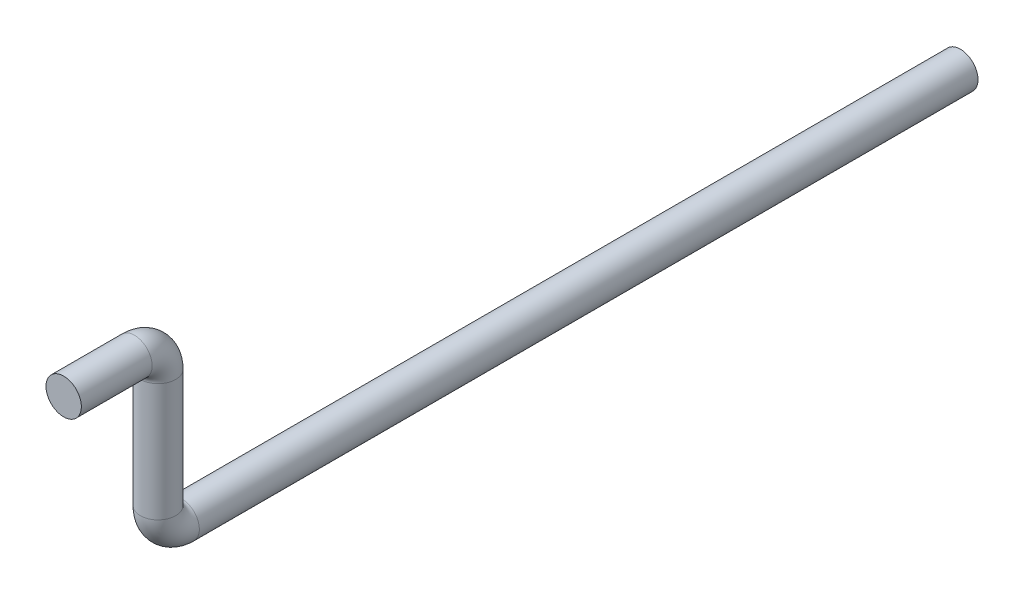
ISO-10303-21;
HEADER;
FILE_DESCRIPTION(('STEP AP214'),'2;1');
FILE_NAME('part.step','',(''),(''),'','','');
FILE_SCHEMA(('AUTOMOTIVE_DESIGN { 1 0 10303 214 1 1 1 1 }'));
ENDSEC;
DATA;
#1=APPLICATION_CONTEXT('core data for automotive mechanical design processes');
#2=APPLICATION_PROTOCOL_DEFINITION('international standard','automotive_design',2000,#1);
#3=PRODUCT_CONTEXT('',#1,'mechanical');
#4=PRODUCT('Part','Part','',(#3));
#5=PRODUCT_RELATED_PRODUCT_CATEGORY('part','',(#4));
#6=PRODUCT_DEFINITION_FORMATION('','',#4);
#7=PRODUCT_DEFINITION_CONTEXT('part definition',#1,'design');
#8=PRODUCT_DEFINITION('design','',#6,#7);
#9=PRODUCT_DEFINITION_SHAPE('','',#8);
#10=(LENGTH_UNIT() NAMED_UNIT(*) SI_UNIT(.MILLI.,.METRE.));
#11=(NAMED_UNIT(*) PLANE_ANGLE_UNIT() SI_UNIT($,.RADIAN.));
#12=(NAMED_UNIT(*) SI_UNIT($,.STERADIAN.) SOLID_ANGLE_UNIT());
#13=UNCERTAINTY_MEASURE_WITH_UNIT(LENGTH_MEASURE(1.E-05),#10,'distance_accuracy_value','');
#14=(GEOMETRIC_REPRESENTATION_CONTEXT(3) GLOBAL_UNCERTAINTY_ASSIGNED_CONTEXT((#13)) GLOBAL_UNIT_ASSIGNED_CONTEXT((#10,
#11,#12)) REPRESENTATION_CONTEXT('',''));
#15=CARTESIAN_POINT('',(0.,0.,0.));
#16=DIRECTION('',(0.,0.,1.));
#17=DIRECTION('',(1.,0.,0.));
#18=AXIS2_PLACEMENT_3D('',#15,#16,#17);
#19=CARTESIAN_POINT('',(0.,70.,80.));
#20=DIRECTION('',(0.,0.,1.));
#21=DIRECTION('',(1.,0.,0.));
#22=AXIS2_PLACEMENT_3D('',#19,#20,#21);
#23=PLANE('',#22);
#24=CARTESIAN_POINT('',(0.,70.,80.));
#25=DIRECTION('',(0.,0.,1.));
#26=DIRECTION('',(1.,0.,0.));
#27=AXIS2_PLACEMENT_3D('',#24,#25,#26);
#28=CIRCLE('',#27,7.5);
#29=CARTESIAN_POINT('',(7.5,70.,80.));
#30=VERTEX_POINT('',#29);
#31=EDGE_CURVE('E11',#30,#30,#28,.T.);
#32=ORIENTED_EDGE('',*,*,#31,.T.);
#33=EDGE_LOOP('',(#32));
#34=FACE_BOUND('',#33,.T.);
#35=ADVANCED_FACE('F33',(#34),#23,.T.);
#36=CARTESIAN_POINT('',(0.,0.,0.));
#37=DIRECTION('',(0.,0.,1.));
#38=DIRECTION('',(1.,0.,0.));
#39=AXIS2_PLACEMENT_3D('',#36,#37,#38);
#40=CYLINDRICAL_SURFACE('',#39,7.5);
#41=CARTESIAN_POINT('',(0.,0.,30.));
#42=DIRECTION('',(0.,0.,1.));
#43=DIRECTION('',(1.,0.,0.));
#44=AXIS2_PLACEMENT_3D('',#41,#42,#43);
#45=CIRCLE('',#44,7.5);
#46=CARTESIAN_POINT('',(0.,-7.5,30.));
#47=VERTEX_POINT('',#46);
#48=EDGE_CURVE('E58',#47,#47,#45,.T.);
#49=ORIENTED_EDGE('',*,*,#48,.F.);
#50=EDGE_LOOP('',(#49));
#51=FACE_BOUND('',#50,.T.);
#52=CARTESIAN_POINT('',(0.,0.,-300.));
#53=DIRECTION('',(0.,0.,-1.));
#54=DIRECTION('',(-1.,0.,0.));
#55=AXIS2_PLACEMENT_3D('',#52,#53,#54);
#56=CIRCLE('',#55,7.5);
#57=CARTESIAN_POINT('',(-7.5,0.,-300.));
#58=VERTEX_POINT('',#57);
#59=EDGE_CURVE('E61',#58,#58,#56,.T.);
#60=ORIENTED_EDGE('',*,*,#59,.F.);
#61=EDGE_LOOP('',(#60));
#62=FACE_BOUND('',#61,.T.);
#63=ADVANCED_FACE('F66',(#51,#62),#40,.T.);
#64=CARTESIAN_POINT('',(0.,10.,30.));
#65=DIRECTION('',(-1.,0.,0.));
#66=DIRECTION('',(0.,0.,1.));
#67=AXIS2_PLACEMENT_3D('',#64,#65,#66);
#68=TOROIDAL_SURFACE('',#67,10.,7.5);
#69=CARTESIAN_POINT('',(0.,10.,40.));
#70=DIRECTION('',(0.,1.,0.));
#71=DIRECTION('',(1.,0.,0.));
#72=AXIS2_PLACEMENT_3D('',#69,#70,#71);
#73=CIRCLE('',#72,7.5);
#74=CARTESIAN_POINT('',(0.,10.,47.5));
#75=VERTEX_POINT('',#74);
#76=EDGE_CURVE('E53',#75,#75,#73,.T.);
#77=CARTESIAN_POINT('',(0.,10.,30.));
#78=DIRECTION('',(-1.,0.,0.));
#79=DIRECTION('',(0.,0.,1.));
#80=AXIS2_PLACEMENT_3D('',#77,#78,#79);
#81=CIRCLE('',#80,17.5);
#82=EDGE_CURVE('',#47,#75,#81,.T.);
#83=ORIENTED_EDGE('',*,*,#48,.T.);
#84=ORIENTED_EDGE('',*,*,#76,.F.);
#85=ORIENTED_EDGE('',*,*,#82,.T.);
#86=ORIENTED_EDGE('',*,*,#82,.F.);
#87=EDGE_LOOP('',(#83,#85,#84,#86));
#88=FACE_BOUND('',#87,.T.);
#89=ADVANCED_FACE('F68',(#88),#68,.T.);
#90=CARTESIAN_POINT('',(0.,10.,40.));
#91=DIRECTION('',(0.,1.,0.));
#92=DIRECTION('',(0.,0.,1.));
#93=AXIS2_PLACEMENT_3D('',#90,#91,#92);
#94=CYLINDRICAL_SURFACE('',#93,7.5);
#95=CARTESIAN_POINT('',(0.,60.,40.));
#96=DIRECTION('',(0.,1.,0.));
#97=DIRECTION('',(1.,0.,0.));
#98=AXIS2_PLACEMENT_3D('',#95,#96,#97);
#99=CIRCLE('',#98,7.5);
#100=CARTESIAN_POINT('',(0.,60.,32.5));
#101=VERTEX_POINT('',#100);
#102=EDGE_CURVE('E51',#101,#101,#99,.T.);
#103=ORIENTED_EDGE('',*,*,#102,.F.);
#104=EDGE_LOOP('',(#103));
#105=FACE_BOUND('',#104,.T.);
#106=ORIENTED_EDGE('',*,*,#76,.T.);
#107=EDGE_LOOP('',(#106));
#108=FACE_BOUND('',#107,.T.);
#109=ADVANCED_FACE('F75',(#105,#108),#94,.T.);
#110=CARTESIAN_POINT('',(0.,60.,50.));
#111=DIRECTION('',(1.,0.,0.));
#112=DIRECTION('',(0.,0.,-1.));
#113=AXIS2_PLACEMENT_3D('',#110,#111,#112);
#114=TOROIDAL_SURFACE('',#113,10.,7.5);
#115=CARTESIAN_POINT('',(0.,70.,50.));
#116=DIRECTION('',(0.,0.,1.));
#117=DIRECTION('',(1.,0.,0.));
#118=AXIS2_PLACEMENT_3D('',#115,#116,#117);
#119=CIRCLE('',#118,7.5);
#120=CARTESIAN_POINT('',(0.,77.5,50.));
#121=VERTEX_POINT('',#120);
#122=EDGE_CURVE('E39',#121,#121,#119,.T.);
#123=CARTESIAN_POINT('',(0.,60.,50.));
#124=DIRECTION('',(1.,0.,0.));
#125=DIRECTION('',(0.,0.,-1.));
#126=AXIS2_PLACEMENT_3D('',#123,#124,#125);
#127=CIRCLE('',#126,17.5);
#128=EDGE_CURVE('',#101,#121,#127,.T.);
#129=ORIENTED_EDGE('',*,*,#102,.T.);
#130=ORIENTED_EDGE('',*,*,#122,.F.);
#131=ORIENTED_EDGE('',*,*,#128,.T.);
#132=ORIENTED_EDGE('',*,*,#128,.F.);
#133=EDGE_LOOP('',(#129,#131,#130,#132));
#134=FACE_BOUND('',#133,.T.);
#135=ADVANCED_FACE('F47',(#134),#114,.T.);
#136=CARTESIAN_POINT('',(0.,70.,50.));
#137=DIRECTION('',(0.,0.,1.));
#138=DIRECTION('',(1.,0.,0.));
#139=AXIS2_PLACEMENT_3D('',#136,#137,#138);
#140=CYLINDRICAL_SURFACE('',#139,7.5);
#141=ORIENTED_EDGE('',*,*,#31,.F.);
#142=EDGE_LOOP('',(#141));
#143=FACE_BOUND('',#142,.T.);
#144=ORIENTED_EDGE('',*,*,#122,.T.);
#145=EDGE_LOOP('',(#144));
#146=FACE_BOUND('',#145,.T.);
#147=ADVANCED_FACE('F43',(#143,#146),#140,.T.);
#148=CARTESIAN_POINT('',(0.,0.,-300.));
#149=DIRECTION('',(0.,0.,-1.));
#150=DIRECTION('',(-1.,0.,0.));
#151=AXIS2_PLACEMENT_3D('',#148,#149,#150);
#152=PLANE('',#151);
#153=ORIENTED_EDGE('',*,*,#59,.T.);
#154=EDGE_LOOP('',(#153));
#155=FACE_BOUND('',#154,.T.);
#156=ADVANCED_FACE('F46',(#155),#152,.T.);
#157=CLOSED_SHELL('',(#35,#63,#89,#109,#135,#147,#156));
#158=MANIFOLD_SOLID_BREP('B2',#157);
#159=ADVANCED_BREP_SHAPE_REPRESENTATION('',(#18,#158),#14);
#160=SHAPE_DEFINITION_REPRESENTATION(#9,#159);
ENDSEC;
END-ISO-10303-21;
